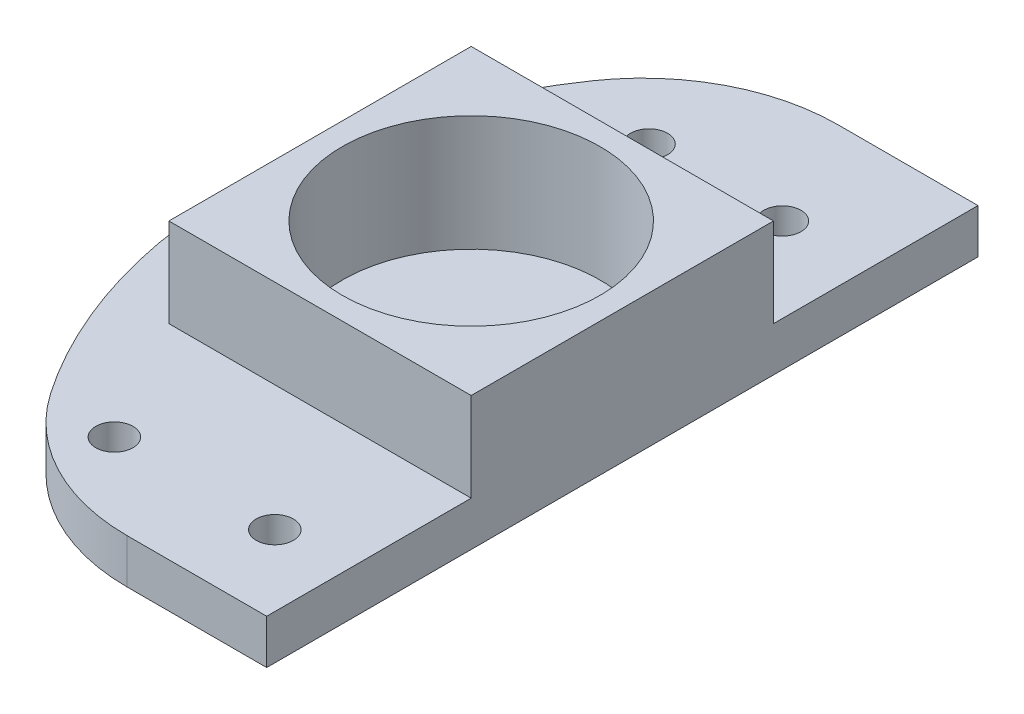
ISO-10303-21;
HEADER;
FILE_DESCRIPTION(('STEP AP214'),'2;1');
FILE_NAME('part.step','',(''),(''),'','','');
FILE_SCHEMA(('AUTOMOTIVE_DESIGN { 1 0 10303 214 1 1 1 1 }'));
ENDSEC;
DATA;
#1=APPLICATION_CONTEXT('core data for automotive mechanical design processes');
#2=APPLICATION_PROTOCOL_DEFINITION('international standard','automotive_design',2000,#1);
#3=PRODUCT_CONTEXT('',#1,'mechanical');
#4=PRODUCT('Part','Part','',(#3));
#5=PRODUCT_RELATED_PRODUCT_CATEGORY('part','',(#4));
#6=PRODUCT_DEFINITION_FORMATION('','',#4);
#7=PRODUCT_DEFINITION_CONTEXT('part definition',#1,'design');
#8=PRODUCT_DEFINITION('design','',#6,#7);
#9=PRODUCT_DEFINITION_SHAPE('','',#8);
#10=(LENGTH_UNIT() NAMED_UNIT(*) SI_UNIT(.MILLI.,.METRE.));
#11=(NAMED_UNIT(*) PLANE_ANGLE_UNIT() SI_UNIT($,.RADIAN.));
#12=(NAMED_UNIT(*) SI_UNIT($,.STERADIAN.) SOLID_ANGLE_UNIT());
#13=UNCERTAINTY_MEASURE_WITH_UNIT(LENGTH_MEASURE(1.E-05),#10,'distance_accuracy_value','');
#14=(GEOMETRIC_REPRESENTATION_CONTEXT(3) GLOBAL_UNCERTAINTY_ASSIGNED_CONTEXT((#13)) GLOBAL_UNIT_ASSIGNED_CONTEXT((#10,
#11,#12)) REPRESENTATION_CONTEXT('',''));
#15=CARTESIAN_POINT('',(0.,0.,0.));
#16=DIRECTION('',(0.,0.,1.));
#17=DIRECTION('',(1.,0.,0.));
#18=AXIS2_PLACEMENT_3D('',#15,#16,#17);
#19=CARTESIAN_POINT('',(0.,6.35,0.));
#20=DIRECTION('',(0.,1.,0.));
#21=DIRECTION('',(0.,0.,1.));
#22=AXIS2_PLACEMENT_3D('',#19,#20,#21);
#23=PLANE('',#22);
#24=CARTESIAN_POINT('',(-9.525,6.35,-34.925));
#25=DIRECTION('',(0.,1.,0.));
#26=DIRECTION('',(0.,0.,1.));
#27=AXIS2_PLACEMENT_3D('',#24,#25,#26);
#28=CIRCLE('',#27,2.65429999999999);
#29=CARTESIAN_POINT('',(-9.525,6.35,-32.2707));
#30=VERTEX_POINT('',#29);
#31=EDGE_CURVE('E363',#30,#30,#28,.T.);
#32=ORIENTED_EDGE('',*,*,#31,.F.);
#33=EDGE_LOOP('',(#32));
#34=FACE_BOUND('',#33,.T.);
#35=CARTESIAN_POINT('',(9.525,6.35,-34.925));
#36=DIRECTION('',(0.,1.,0.));
#37=DIRECTION('',(0.,0.,1.));
#38=AXIS2_PLACEMENT_3D('',#35,#36,#37);
#39=CIRCLE('',#38,2.65429999999999);
#40=CARTESIAN_POINT('',(9.525,6.35,-32.2707));
#41=VERTEX_POINT('',#40);
#42=EDGE_CURVE('E365',#41,#41,#39,.T.);
#43=ORIENTED_EDGE('',*,*,#42,.F.);
#44=EDGE_LOOP('',(#43));
#45=FACE_BOUND('',#44,.T.);
#46=CARTESIAN_POINT('',(11.4568909611128,6.35,39.5116158235074));
#47=DIRECTION('',(0.,1.,0.));
#48=DIRECTION('',(0.,0.,1.));
#49=AXIS2_PLACEMENT_3D('',#46,#47,#48);
#50=CIRCLE('',#49,2.65429999999999);
#51=CARTESIAN_POINT('',(11.4568909611128,6.35,42.1659158235074));
#52=VERTEX_POINT('',#51);
#53=EDGE_CURVE('E373',#52,#52,#50,.T.);
#54=ORIENTED_EDGE('',*,*,#53,.F.);
#55=EDGE_LOOP('',(#54));
#56=FACE_BOUND('',#55,.T.);
#57=CARTESIAN_POINT('',(-11.4568909611128,6.35,39.5116158235074));
#58=DIRECTION('',(0.,1.,0.));
#59=DIRECTION('',(0.,0.,1.));
#60=AXIS2_PLACEMENT_3D('',#57,#58,#59);
#61=CIRCLE('',#60,2.65429999999999);
#62=CARTESIAN_POINT('',(-11.4568909611128,6.35,42.1659158235074));
#63=VERTEX_POINT('',#62);
#64=EDGE_CURVE('E143',#63,#63,#61,.T.);
#65=ORIENTED_EDGE('',*,*,#64,.F.);
#66=EDGE_LOOP('',(#65));
#67=FACE_BOUND('',#66,.T.);
#68=DIRECTION('',(-1.,0.,0.));
#69=VECTOR('',#68,1.);
#70=CARTESIAN_POINT('',(0.,6.35,-50.8));
#71=LINE('',#70,#69);
#72=CARTESIAN_POINT('',(21.59,6.35,-50.8));
#73=VERTEX_POINT('',#72);
#74=CARTESIAN_POINT('',(1.63161633297087,6.35,-50.8));
#75=VERTEX_POINT('',#74);
#76=EDGE_CURVE('E127',#73,#75,#71,.T.);
#77=ORIENTED_EDGE('',*,*,#76,.T.);
#78=CARTESIAN_POINT('',(1.63161633297088,6.35,-22.86));
#79=DIRECTION('',(0.,1.,0.));
#80=DIRECTION('',(0.,0.,1.));
#81=AXIS2_PLACEMENT_3D('',#78,#79,#80);
#82=CIRCLE('',#81,27.94);
#83=CARTESIAN_POINT('',(-21.4015421788103,6.35,-38.6750943396226));
#84=VERTEX_POINT('',#83);
#85=EDGE_CURVE('E194',#75,#84,#82,.T.);
#86=ORIENTED_EDGE('',*,*,#85,.T.);
#87=CARTESIAN_POINT('',(34.925,6.35,0.));
#88=DIRECTION('',(0.,1.,0.));
#89=DIRECTION('',(0.,0.,1.));
#90=AXIS2_PLACEMENT_3D('',#87,#88,#89);
#91=CIRCLE('',#90,68.326);
#92=CARTESIAN_POINT('',(-21.4015421788102,6.35,38.6750943396227));
#93=VERTEX_POINT('',#92);
#94=EDGE_CURVE('E132',#84,#93,#91,.T.);
#95=ORIENTED_EDGE('',*,*,#94,.T.);
#96=CARTESIAN_POINT('',(1.63161633297088,6.35,22.86));
#97=DIRECTION('',(0.,1.,0.));
#98=DIRECTION('',(0.,0.,1.));
#99=AXIS2_PLACEMENT_3D('',#96,#97,#98);
#100=CIRCLE('',#99,27.94);
#101=CARTESIAN_POINT('',(1.63161633297089,6.35,50.8));
#102=VERTEX_POINT('',#101);
#103=EDGE_CURVE('E192',#93,#102,#100,.T.);
#104=ORIENTED_EDGE('',*,*,#103,.T.);
#105=DIRECTION('',(-1.,0.,0.));
#106=VECTOR('',#105,1.);
#107=CARTESIAN_POINT('',(0.,6.35,50.8));
#108=LINE('',#107,#106);
#109=CARTESIAN_POINT('',(21.59,6.35,50.8));
#110=VERTEX_POINT('',#109);
#111=EDGE_CURVE('E141',#110,#102,#108,.T.);
#112=ORIENTED_EDGE('',*,*,#111,.F.);
#113=DIRECTION('',(0.,0.,-1.));
#114=VECTOR('',#113,1.);
#115=CARTESIAN_POINT('',(21.59,6.35,0.));
#116=LINE('',#115,#114);
#117=CARTESIAN_POINT('',(21.59,6.35,21.59));
#118=VERTEX_POINT('',#117);
#119=EDGE_CURVE('E138',#110,#118,#116,.T.);
#120=ORIENTED_EDGE('',*,*,#119,.T.);
#121=DIRECTION('',(1.,0.,0.));
#122=VECTOR('',#121,1.);
#123=CARTESIAN_POINT('',(0.,6.35,21.59));
#124=LINE('',#123,#122);
#125=CARTESIAN_POINT('',(-21.59,6.35,21.59));
#126=VERTEX_POINT('',#125);
#127=EDGE_CURVE('E152',#126,#118,#124,.T.);
#128=ORIENTED_EDGE('',*,*,#127,.F.);
#129=DIRECTION('',(0.,0.,-1.));
#130=VECTOR('',#129,1.);
#131=CARTESIAN_POINT('',(-21.59,6.35,0.));
#132=LINE('',#131,#130);
#133=CARTESIAN_POINT('',(-21.59,6.35,-21.59));
#134=VERTEX_POINT('',#133);
#135=EDGE_CURVE('E155',#126,#134,#132,.T.);
#136=ORIENTED_EDGE('',*,*,#135,.T.);
#137=DIRECTION('',(1.,0.,0.));
#138=VECTOR('',#137,1.);
#139=CARTESIAN_POINT('',(0.,6.35,-21.59));
#140=LINE('',#139,#138);
#141=CARTESIAN_POINT('',(21.59,6.35,-21.59));
#142=VERTEX_POINT('',#141);
#143=EDGE_CURVE('E137',#134,#142,#140,.T.);
#144=ORIENTED_EDGE('',*,*,#143,.T.);
#145=EDGE_CURVE('E114',#142,#73,#116,.T.);
#146=ORIENTED_EDGE('',*,*,#145,.T.);
#147=EDGE_LOOP('',(#77,#86,#95,#104,#112,#120,#128,#136,#144,#146));
#148=FACE_BOUND('',#147,.T.);
#149=ADVANCED_FACE('F34',(#34,#45,#56,#67,#148),#23,.T.);
#150=CARTESIAN_POINT('',(0.,19.05,0.));
#151=DIRECTION('',(0.,1.,0.));
#152=DIRECTION('',(0.,0.,1.));
#153=AXIS2_PLACEMENT_3D('',#150,#151,#152);
#154=PLANE('',#153);
#155=CARTESIAN_POINT('',(0.,19.05,0.));
#156=DIRECTION('',(0.,1.,0.));
#157=DIRECTION('',(0.,0.,1.));
#158=AXIS2_PLACEMENT_3D('',#155,#156,#157);
#159=CIRCLE('',#158,18.415);
#160=CARTESIAN_POINT('',(0.,19.05,18.415));
#161=VERTEX_POINT('',#160);
#162=EDGE_CURVE('E172',#161,#161,#159,.T.);
#163=ORIENTED_EDGE('',*,*,#162,.F.);
#164=EDGE_LOOP('',(#163));
#165=FACE_BOUND('',#164,.T.);
#166=DIRECTION('',(1.,0.,0.));
#167=VECTOR('',#166,1.);
#168=CARTESIAN_POINT('',(0.,19.05,21.59));
#169=LINE('',#168,#167);
#170=CARTESIAN_POINT('',(-21.59,19.05,21.59));
#171=VERTEX_POINT('',#170);
#172=CARTESIAN_POINT('',(21.59,19.05,21.59));
#173=VERTEX_POINT('',#172);
#174=EDGE_CURVE('E162',#171,#173,#169,.T.);
#175=ORIENTED_EDGE('',*,*,#174,.T.);
#176=DIRECTION('',(0.,0.,-1.));
#177=VECTOR('',#176,1.);
#178=CARTESIAN_POINT('',(21.59,19.05,0.));
#179=LINE('',#178,#177);
#180=CARTESIAN_POINT('',(21.59,19.05,-21.59));
#181=VERTEX_POINT('',#180);
#182=EDGE_CURVE('E122',#173,#181,#179,.T.);
#183=ORIENTED_EDGE('',*,*,#182,.T.);
#184=DIRECTION('',(1.,0.,0.));
#185=VECTOR('',#184,1.);
#186=CARTESIAN_POINT('',(0.,19.05,-21.59));
#187=LINE('',#186,#185);
#188=CARTESIAN_POINT('',(-21.59,19.05,-21.59));
#189=VERTEX_POINT('',#188);
#190=EDGE_CURVE('E156',#189,#181,#187,.T.);
#191=ORIENTED_EDGE('',*,*,#190,.F.);
#192=DIRECTION('',(0.,0.,-1.));
#193=VECTOR('',#192,1.);
#194=CARTESIAN_POINT('',(-21.59,19.05,0.));
#195=LINE('',#194,#193);
#196=EDGE_CURVE('E165',#171,#189,#195,.T.);
#197=ORIENTED_EDGE('',*,*,#196,.F.);
#198=EDGE_LOOP('',(#175,#183,#191,#197));
#199=FACE_BOUND('',#198,.T.);
#200=ADVANCED_FACE('F226',(#165,#199),#154,.T.);
#201=CARTESIAN_POINT('',(0.,2.54,0.));
#202=DIRECTION('',(0.,1.,0.));
#203=DIRECTION('',(0.,0.,1.));
#204=AXIS2_PLACEMENT_3D('',#201,#202,#203);
#205=CYLINDRICAL_SURFACE('',#204,18.415);
#206=CARTESIAN_POINT('',(0.,2.54,0.));
#207=DIRECTION('',(0.,1.,0.));
#208=DIRECTION('',(0.,0.,1.));
#209=AXIS2_PLACEMENT_3D('',#206,#207,#208);
#210=CIRCLE('',#209,18.415);
#211=CARTESIAN_POINT('',(0.,2.54,18.415));
#212=VERTEX_POINT('',#211);
#213=EDGE_CURVE('E179',#212,#212,#210,.T.);
#214=ORIENTED_EDGE('',*,*,#213,.F.);
#215=EDGE_LOOP('',(#214));
#216=FACE_BOUND('',#215,.T.);
#217=ORIENTED_EDGE('',*,*,#162,.T.);
#218=EDGE_LOOP('',(#217));
#219=FACE_BOUND('',#218,.T.);
#220=ADVANCED_FACE('F228',(#216,#219),#205,.F.);
#221=CARTESIAN_POINT('',(0.,2.54,0.));
#222=DIRECTION('',(0.,1.,0.));
#223=DIRECTION('',(0.,0.,1.));
#224=AXIS2_PLACEMENT_3D('',#221,#222,#223);
#225=PLANE('',#224);
#226=ORIENTED_EDGE('',*,*,#213,.T.);
#227=EDGE_LOOP('',(#226));
#228=FACE_BOUND('',#227,.T.);
#229=ADVANCED_FACE('F235',(#228),#225,.T.);
#230=CARTESIAN_POINT('',(21.59,6.35,0.));
#231=DIRECTION('',(1.,0.,0.));
#232=DIRECTION('',(0.,0.,-1.));
#233=AXIS2_PLACEMENT_3D('',#230,#231,#232);
#234=PLANE('',#233);
#235=ORIENTED_EDGE('',*,*,#182,.F.);
#236=DIRECTION('',(0.,1.,0.));
#237=VECTOR('',#236,1.);
#238=CARTESIAN_POINT('',(21.59,6.35,21.59));
#239=LINE('',#238,#237);
#240=EDGE_CURVE('E159',#118,#173,#239,.T.);
#241=ORIENTED_EDGE('',*,*,#240,.F.);
#242=ORIENTED_EDGE('',*,*,#119,.F.);
#243=DIRECTION('',(0.,1.,0.));
#244=VECTOR('',#243,1.);
#245=CARTESIAN_POINT('',(21.59,-6.35,50.8));
#246=LINE('',#245,#244);
#247=CARTESIAN_POINT('',(21.59,0.,50.8));
#248=VERTEX_POINT('',#247);
#249=EDGE_CURVE('E123',#248,#110,#246,.T.);
#250=ORIENTED_EDGE('',*,*,#249,.F.);
#251=DIRECTION('',(0.,0.,-1.));
#252=VECTOR('',#251,1.);
#253=CARTESIAN_POINT('',(21.59,0.,0.));
#254=LINE('',#253,#252);
#255=CARTESIAN_POINT('',(21.59,0.,-50.8));
#256=VERTEX_POINT('',#255);
#257=EDGE_CURVE('E118',#248,#256,#254,.T.);
#258=ORIENTED_EDGE('',*,*,#257,.T.);
#259=DIRECTION('',(0.,1.,0.));
#260=VECTOR('',#259,1.);
#261=CARTESIAN_POINT('',(21.59,-6.35,-50.8));
#262=LINE('',#261,#260);
#263=EDGE_CURVE('E110',#256,#73,#262,.T.);
#264=ORIENTED_EDGE('',*,*,#263,.T.);
#265=ORIENTED_EDGE('',*,*,#145,.F.);
#266=DIRECTION('',(0.,1.,0.));
#267=VECTOR('',#266,1.);
#268=CARTESIAN_POINT('',(21.59,6.35,-21.59));
#269=LINE('',#268,#267);
#270=EDGE_CURVE('E170',#142,#181,#269,.T.);
#271=ORIENTED_EDGE('',*,*,#270,.T.);
#272=EDGE_LOOP('',(#235,#241,#242,#250,#258,#264,#265,#271));
#273=FACE_BOUND('',#272,.T.);
#274=ADVANCED_FACE('F112',(#273),#234,.T.);
#275=CARTESIAN_POINT('',(0.,6.35,-21.59));
#276=DIRECTION('',(0.,0.,1.));
#277=DIRECTION('',(1.,0.,0.));
#278=AXIS2_PLACEMENT_3D('',#275,#276,#277);
#279=PLANE('',#278);
#280=ORIENTED_EDGE('',*,*,#190,.T.);
#281=ORIENTED_EDGE('',*,*,#270,.F.);
#282=ORIENTED_EDGE('',*,*,#143,.F.);
#283=DIRECTION('',(0.,1.,0.));
#284=VECTOR('',#283,1.);
#285=CARTESIAN_POINT('',(-21.59,6.35,-21.59));
#286=LINE('',#285,#284);
#287=EDGE_CURVE('E173',#134,#189,#286,.T.);
#288=ORIENTED_EDGE('',*,*,#287,.T.);
#289=EDGE_LOOP('',(#280,#281,#282,#288));
#290=FACE_BOUND('',#289,.T.);
#291=ADVANCED_FACE('F224',(#290),#279,.F.);
#292=CARTESIAN_POINT('',(-21.59,6.35,0.));
#293=DIRECTION('',(1.,0.,0.));
#294=DIRECTION('',(0.,0.,-1.));
#295=AXIS2_PLACEMENT_3D('',#292,#293,#294);
#296=PLANE('',#295);
#297=ORIENTED_EDGE('',*,*,#196,.T.);
#298=ORIENTED_EDGE('',*,*,#287,.F.);
#299=ORIENTED_EDGE('',*,*,#135,.F.);
#300=DIRECTION('',(0.,1.,0.));
#301=VECTOR('',#300,1.);
#302=CARTESIAN_POINT('',(-21.59,6.35,21.59));
#303=LINE('',#302,#301);
#304=EDGE_CURVE('E175',#126,#171,#303,.T.);
#305=ORIENTED_EDGE('',*,*,#304,.T.);
#306=EDGE_LOOP('',(#297,#298,#299,#305));
#307=FACE_BOUND('',#306,.T.);
#308=ADVANCED_FACE('F221',(#307),#296,.F.);
#309=CARTESIAN_POINT('',(0.,6.35,21.59));
#310=DIRECTION('',(0.,0.,1.));
#311=DIRECTION('',(1.,0.,0.));
#312=AXIS2_PLACEMENT_3D('',#309,#310,#311);
#313=PLANE('',#312);
#314=ORIENTED_EDGE('',*,*,#174,.F.);
#315=ORIENTED_EDGE('',*,*,#304,.F.);
#316=ORIENTED_EDGE('',*,*,#127,.T.);
#317=ORIENTED_EDGE('',*,*,#240,.T.);
#318=EDGE_LOOP('',(#314,#315,#316,#317));
#319=FACE_BOUND('',#318,.T.);
#320=ADVANCED_FACE('F218',(#319),#313,.T.);
#321=CARTESIAN_POINT('',(0.,-6.35,-50.8));
#322=DIRECTION('',(0.,0.,-1.));
#323=DIRECTION('',(-1.,0.,0.));
#324=AXIS2_PLACEMENT_3D('',#321,#322,#323);
#325=PLANE('',#324);
#326=DIRECTION('',(-1.,0.,0.));
#327=VECTOR('',#326,1.);
#328=CARTESIAN_POINT('',(0.,0.,-50.8));
#329=LINE('',#328,#327);
#330=CARTESIAN_POINT('',(1.63161633297087,0.,-50.8));
#331=VERTEX_POINT('',#330);
#332=EDGE_CURVE('E188',#256,#331,#329,.T.);
#333=ORIENTED_EDGE('',*,*,#332,.T.);
#334=DIRECTION('',(0.,1.,0.));
#335=VECTOR('',#334,1.);
#336=CARTESIAN_POINT('',(1.63161633297087,-6.35,-50.8));
#337=LINE('',#336,#335);
#338=EDGE_CURVE('E130',#331,#75,#337,.T.);
#339=ORIENTED_EDGE('',*,*,#338,.T.);
#340=ORIENTED_EDGE('',*,*,#76,.F.);
#341=ORIENTED_EDGE('',*,*,#263,.F.);
#342=EDGE_LOOP('',(#333,#339,#340,#341));
#343=FACE_BOUND('',#342,.T.);
#344=ADVANCED_FACE('F128',(#343),#325,.T.);
#345=CARTESIAN_POINT('',(34.925,-6.35,0.));
#346=DIRECTION('',(0.,1.,0.));
#347=DIRECTION('',(0.,0.,1.));
#348=AXIS2_PLACEMENT_3D('',#345,#346,#347);
#349=CYLINDRICAL_SURFACE('',#348,68.326);
#350=ORIENTED_EDGE('',*,*,#94,.F.);
#351=DIRECTION('',(0.,1.,0.));
#352=VECTOR('',#351,1.);
#353=CARTESIAN_POINT('',(-21.4015421788103,-6.35,-38.6750943396226));
#354=LINE('',#353,#352);
#355=CARTESIAN_POINT('',(-21.4015421788103,0.,-38.6750943396226));
#356=VERTEX_POINT('',#355);
#357=EDGE_CURVE('E199',#84,#356,#354,.F.);
#358=ORIENTED_EDGE('',*,*,#357,.T.);
#359=CARTESIAN_POINT('',(34.925,0.,0.));
#360=DIRECTION('',(0.,1.,0.));
#361=DIRECTION('',(0.,0.,1.));
#362=AXIS2_PLACEMENT_3D('',#359,#360,#361);
#363=CIRCLE('',#362,68.326);
#364=CARTESIAN_POINT('',(-21.4015421788102,0.,38.6750943396227));
#365=VERTEX_POINT('',#364);
#366=EDGE_CURVE('E186',#356,#365,#363,.T.);
#367=ORIENTED_EDGE('',*,*,#366,.T.);
#368=DIRECTION('',(0.,1.,0.));
#369=VECTOR('',#368,1.);
#370=CARTESIAN_POINT('',(-21.4015421788103,-6.35,38.6750943396227));
#371=LINE('',#370,#369);
#372=EDGE_CURVE('E196',#365,#93,#371,.T.);
#373=ORIENTED_EDGE('',*,*,#372,.T.);
#374=EDGE_LOOP('',(#350,#358,#367,#373));
#375=FACE_BOUND('',#374,.T.);
#376=ADVANCED_FACE('F208',(#375),#349,.T.);
#377=CARTESIAN_POINT('',(0.,-6.35,50.8));
#378=DIRECTION('',(0.,0.,-1.));
#379=DIRECTION('',(-1.,0.,0.));
#380=AXIS2_PLACEMENT_3D('',#377,#378,#379);
#381=PLANE('',#380);
#382=ORIENTED_EDGE('',*,*,#111,.T.);
#383=DIRECTION('',(0.,-1.,0.));
#384=VECTOR('',#383,1.);
#385=CARTESIAN_POINT('',(1.63161633297089,0.,50.8));
#386=LINE('',#385,#384);
#387=CARTESIAN_POINT('',(1.63161633297089,0.,50.8));
#388=VERTEX_POINT('',#387);
#389=EDGE_CURVE('E11',#102,#388,#386,.T.);
#390=ORIENTED_EDGE('',*,*,#389,.T.);
#391=DIRECTION('',(-1.,0.,0.));
#392=VECTOR('',#391,1.);
#393=CARTESIAN_POINT('',(0.,0.,50.8));
#394=LINE('',#393,#392);
#395=EDGE_CURVE('E182',#248,#388,#394,.T.);
#396=ORIENTED_EDGE('',*,*,#395,.F.);
#397=ORIENTED_EDGE('',*,*,#249,.T.);
#398=EDGE_LOOP('',(#382,#390,#396,#397));
#399=FACE_BOUND('',#398,.T.);
#400=ADVANCED_FACE('F212',(#399),#381,.F.);
#401=CARTESIAN_POINT('',(0.,0.,0.));
#402=DIRECTION('',(0.,1.,0.));
#403=DIRECTION('',(0.,0.,1.));
#404=AXIS2_PLACEMENT_3D('',#401,#402,#403);
#405=PLANE('',#404);
#406=CARTESIAN_POINT('',(-9.525,0.,-34.925));
#407=DIRECTION('',(0.,1.,0.));
#408=DIRECTION('',(0.,0.,1.));
#409=AXIS2_PLACEMENT_3D('',#406,#407,#408);
#410=CIRCLE('',#409,2.65429999999999);
#411=CARTESIAN_POINT('',(-9.525,0.,-32.2707));
#412=VERTEX_POINT('',#411);
#413=EDGE_CURVE('E360',#412,#412,#410,.T.);
#414=ORIENTED_EDGE('',*,*,#413,.T.);
#415=EDGE_LOOP('',(#414));
#416=FACE_BOUND('',#415,.T.);
#417=CARTESIAN_POINT('',(9.525,0.,-34.925));
#418=DIRECTION('',(0.,1.,0.));
#419=DIRECTION('',(0.,0.,1.));
#420=AXIS2_PLACEMENT_3D('',#417,#418,#419);
#421=CIRCLE('',#420,2.65429999999999);
#422=CARTESIAN_POINT('',(9.525,0.,-32.2707));
#423=VERTEX_POINT('',#422);
#424=EDGE_CURVE('E370',#423,#423,#421,.T.);
#425=ORIENTED_EDGE('',*,*,#424,.T.);
#426=EDGE_LOOP('',(#425));
#427=FACE_BOUND('',#426,.T.);
#428=CARTESIAN_POINT('',(11.4568909611128,0.,39.5116158235074));
#429=DIRECTION('',(0.,1.,0.));
#430=DIRECTION('',(0.,0.,1.));
#431=AXIS2_PLACEMENT_3D('',#428,#429,#430);
#432=CIRCLE('',#431,2.65429999999999);
#433=CARTESIAN_POINT('',(11.4568909611128,0.,42.1659158235074));
#434=VERTEX_POINT('',#433);
#435=EDGE_CURVE('E376',#434,#434,#432,.T.);
#436=ORIENTED_EDGE('',*,*,#435,.T.);
#437=EDGE_LOOP('',(#436));
#438=FACE_BOUND('',#437,.T.);
#439=CARTESIAN_POINT('',(-11.4568909611128,0.,39.5116158235074));
#440=DIRECTION('',(0.,1.,0.));
#441=DIRECTION('',(0.,0.,1.));
#442=AXIS2_PLACEMENT_3D('',#439,#440,#441);
#443=CIRCLE('',#442,2.65429999999999);
#444=CARTESIAN_POINT('',(-11.4568909611128,0.,42.1659158235074));
#445=VERTEX_POINT('',#444);
#446=EDGE_CURVE('E139',#445,#445,#443,.T.);
#447=ORIENTED_EDGE('',*,*,#446,.T.);
#448=EDGE_LOOP('',(#447));
#449=FACE_BOUND('',#448,.T.);
#450=ORIENTED_EDGE('',*,*,#366,.F.);
#451=CARTESIAN_POINT('',(1.63161633297088,0.,-22.86));
#452=DIRECTION('',(0.,1.,0.));
#453=DIRECTION('',(0.,0.,1.));
#454=AXIS2_PLACEMENT_3D('',#451,#452,#453);
#455=CIRCLE('',#454,27.94);
#456=EDGE_CURVE('E42',#356,#331,#455,.F.);
#457=ORIENTED_EDGE('',*,*,#456,.T.);
#458=ORIENTED_EDGE('',*,*,#332,.F.);
#459=ORIENTED_EDGE('',*,*,#257,.F.);
#460=ORIENTED_EDGE('',*,*,#395,.T.);
#461=CARTESIAN_POINT('',(1.63161633297088,0.,22.86));
#462=DIRECTION('',(0.,1.,0.));
#463=DIRECTION('',(0.,0.,1.));
#464=AXIS2_PLACEMENT_3D('',#461,#462,#463);
#465=CIRCLE('',#464,27.94);
#466=EDGE_CURVE('E54',#388,#365,#465,.F.);
#467=ORIENTED_EDGE('',*,*,#466,.T.);
#468=EDGE_LOOP('',(#450,#457,#458,#459,#460,#467));
#469=FACE_BOUND('',#468,.T.);
#470=ADVANCED_FACE('F202',(#416,#427,#438,#449,#469),#405,.F.);
#471=CARTESIAN_POINT('',(1.63161633297088,-6.35,-22.86));
#472=DIRECTION('',(0.,1.,0.));
#473=DIRECTION('',(0.,0.,1.));
#474=AXIS2_PLACEMENT_3D('',#471,#472,#473);
#475=CYLINDRICAL_SURFACE('',#474,27.94);
#476=ORIENTED_EDGE('',*,*,#456,.F.);
#477=ORIENTED_EDGE('',*,*,#357,.F.);
#478=ORIENTED_EDGE('',*,*,#85,.F.);
#479=ORIENTED_EDGE('',*,*,#338,.F.);
#480=EDGE_LOOP('',(#476,#477,#478,#479));
#481=FACE_BOUND('',#480,.T.);
#482=ADVANCED_FACE('F205',(#481),#475,.T.);
#483=CARTESIAN_POINT('',(1.63161633297088,-6.35,22.86));
#484=DIRECTION('',(0.,1.,0.));
#485=DIRECTION('',(0.,0.,1.));
#486=AXIS2_PLACEMENT_3D('',#483,#484,#485);
#487=CYLINDRICAL_SURFACE('',#486,27.94);
#488=ORIENTED_EDGE('',*,*,#466,.F.);
#489=ORIENTED_EDGE('',*,*,#389,.F.);
#490=ORIENTED_EDGE('',*,*,#103,.F.);
#491=ORIENTED_EDGE('',*,*,#372,.F.);
#492=EDGE_LOOP('',(#488,#489,#490,#491));
#493=FACE_BOUND('',#492,.T.);
#494=ADVANCED_FACE('F36',(#493),#487,.T.);
#495=CARTESIAN_POINT('',(-11.4568909611128,6.35,39.5116158235074));
#496=DIRECTION('',(0.,1.,0.));
#497=DIRECTION('',(0.,0.,1.));
#498=AXIS2_PLACEMENT_3D('',#495,#496,#497);
#499=CYLINDRICAL_SURFACE('',#498,2.65429999999999);
#500=ORIENTED_EDGE('',*,*,#446,.F.);
#501=EDGE_LOOP('',(#500));
#502=FACE_BOUND('',#501,.T.);
#503=ORIENTED_EDGE('',*,*,#64,.T.);
#504=EDGE_LOOP('',(#503));
#505=FACE_BOUND('',#504,.T.);
#506=ADVANCED_FACE('F249',(#502,#505),#499,.F.);
#507=CARTESIAN_POINT('',(11.4568909611128,6.35,39.5116158235074));
#508=DIRECTION('',(0.,1.,0.));
#509=DIRECTION('',(0.,0.,1.));
#510=AXIS2_PLACEMENT_3D('',#507,#508,#509);
#511=CYLINDRICAL_SURFACE('',#510,2.65429999999999);
#512=ORIENTED_EDGE('',*,*,#435,.F.);
#513=EDGE_LOOP('',(#512));
#514=FACE_BOUND('',#513,.T.);
#515=ORIENTED_EDGE('',*,*,#53,.T.);
#516=EDGE_LOOP('',(#515));
#517=FACE_BOUND('',#516,.T.);
#518=ADVANCED_FACE('F253',(#514,#517),#511,.F.);
#519=CARTESIAN_POINT('',(9.525,6.35,-34.925));
#520=DIRECTION('',(0.,1.,0.));
#521=DIRECTION('',(0.,0.,1.));
#522=AXIS2_PLACEMENT_3D('',#519,#520,#521);
#523=CYLINDRICAL_SURFACE('',#522,2.65429999999999);
#524=ORIENTED_EDGE('',*,*,#424,.F.);
#525=EDGE_LOOP('',(#524));
#526=FACE_BOUND('',#525,.T.);
#527=ORIENTED_EDGE('',*,*,#42,.T.);
#528=EDGE_LOOP('',(#527));
#529=FACE_BOUND('',#528,.T.);
#530=ADVANCED_FACE('F259',(#526,#529),#523,.F.);
#531=CARTESIAN_POINT('',(-9.525,6.35,-34.925));
#532=DIRECTION('',(0.,1.,0.));
#533=DIRECTION('',(0.,0.,1.));
#534=AXIS2_PLACEMENT_3D('',#531,#532,#533);
#535=CYLINDRICAL_SURFACE('',#534,2.65429999999999);
#536=ORIENTED_EDGE('',*,*,#413,.F.);
#537=EDGE_LOOP('',(#536));
#538=FACE_BOUND('',#537,.T.);
#539=ORIENTED_EDGE('',*,*,#31,.T.);
#540=EDGE_LOOP('',(#539));
#541=FACE_BOUND('',#540,.T.);
#542=ADVANCED_FACE('F344',(#538,#541),#535,.F.);
#543=CLOSED_SHELL('',(#149,#200,#220,#229,#274,#291,#308,#320,#344,#376,#400,#470,#482,#494,
#506,#518,#530,#542));
#544=MANIFOLD_SOLID_BREP('B2',#543);
#545=ADVANCED_BREP_SHAPE_REPRESENTATION('',(#18,#544),#14);
#546=SHAPE_DEFINITION_REPRESENTATION(#9,#545);
ENDSEC;
END-ISO-10303-21;
